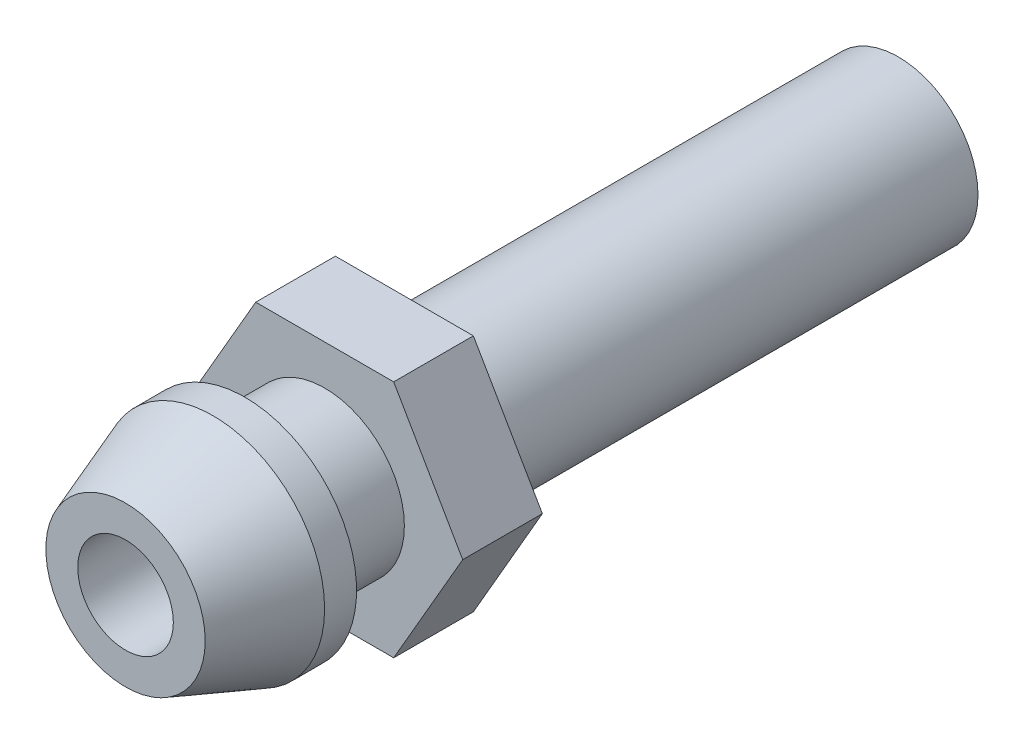
ISO-10303-21;
HEADER;
FILE_DESCRIPTION(('STEP AP214'),'2;1');
FILE_NAME('part.step','',(''),(''),'','','');
FILE_SCHEMA(('AUTOMOTIVE_DESIGN { 1 0 10303 214 1 1 1 1 }'));
ENDSEC;
DATA;
#1=APPLICATION_CONTEXT('core data for automotive mechanical design processes');
#2=APPLICATION_PROTOCOL_DEFINITION('international standard','automotive_design',2000,#1);
#3=PRODUCT_CONTEXT('',#1,'mechanical');
#4=PRODUCT('Part','Part','',(#3));
#5=PRODUCT_RELATED_PRODUCT_CATEGORY('part','',(#4));
#6=PRODUCT_DEFINITION_FORMATION('','',#4);
#7=PRODUCT_DEFINITION_CONTEXT('part definition',#1,'design');
#8=PRODUCT_DEFINITION('design','',#6,#7);
#9=PRODUCT_DEFINITION_SHAPE('','',#8);
#10=(LENGTH_UNIT() NAMED_UNIT(*) SI_UNIT(.MILLI.,.METRE.));
#11=(NAMED_UNIT(*) PLANE_ANGLE_UNIT() SI_UNIT($,.RADIAN.));
#12=(NAMED_UNIT(*) SI_UNIT($,.STERADIAN.) SOLID_ANGLE_UNIT());
#13=UNCERTAINTY_MEASURE_WITH_UNIT(LENGTH_MEASURE(1.E-05),#10,'distance_accuracy_value','');
#14=(GEOMETRIC_REPRESENTATION_CONTEXT(3) GLOBAL_UNCERTAINTY_ASSIGNED_CONTEXT((#13)) GLOBAL_UNIT_ASSIGNED_CONTEXT((#10,
#11,#12)) REPRESENTATION_CONTEXT('',''));
#15=CARTESIAN_POINT('',(0.,0.,0.));
#16=DIRECTION('',(0.,0.,1.));
#17=DIRECTION('',(1.,0.,0.));
#18=AXIS2_PLACEMENT_3D('',#15,#16,#17);
#19=CARTESIAN_POINT('',(0.,0.,12.319));
#20=DIRECTION('',(0.,0.,-1.));
#21=DIRECTION('',(1.,0.,0.));
#22=AXIS2_PLACEMENT_3D('',#19,#20,#21);
#23=CONICAL_SURFACE('',#22,1.27,0.349065850398867);
#24=CARTESIAN_POINT('',(0.,0.,12.319));
#25=DIRECTION('',(0.,0.,1.));
#26=DIRECTION('',(1.,0.,0.));
#27=AXIS2_PLACEMENT_3D('',#24,#25,#26);
#28=CIRCLE('',#27,1.27);
#29=CARTESIAN_POINT('',(1.27,0.,12.319));
#30=VERTEX_POINT('',#29);
#31=EDGE_CURVE('E11',#30,#30,#28,.T.);
#32=ORIENTED_EDGE('',*,*,#31,.F.);
#33=EDGE_LOOP('',(#32));
#34=FACE_BOUND('',#33,.T.);
#35=CARTESIAN_POINT('',(0.,0.,10.9232814709171));
#36=DIRECTION('',(0.,0.,-1.));
#37=DIRECTION('',(-1.,0.,0.));
#38=AXIS2_PLACEMENT_3D('',#35,#36,#37);
#39=CIRCLE('',#38,1.778);
#40=CARTESIAN_POINT('',(-1.778,0.,10.9232814709171));
#41=VERTEX_POINT('',#40);
#42=EDGE_CURVE('E61',#41,#41,#39,.T.);
#43=ORIENTED_EDGE('',*,*,#42,.F.);
#44=EDGE_LOOP('',(#43));
#45=FACE_BOUND('',#44,.T.);
#46=ADVANCED_FACE('F47',(#34,#45),#23,.T.);
#47=CARTESIAN_POINT('',(0.,0.,10.414));
#48=DIRECTION('',(0.,0.,1.));
#49=DIRECTION('',(1.,0.,0.));
#50=AXIS2_PLACEMENT_3D('',#47,#48,#49);
#51=PLANE('',#50);
#52=CARTESIAN_POINT('',(0.,0.,10.414));
#53=DIRECTION('',(0.,0.,1.));
#54=DIRECTION('',(1.,0.,0.));
#55=AXIS2_PLACEMENT_3D('',#52,#53,#54);
#56=CIRCLE('',#55,0.762);
#57=CARTESIAN_POINT('',(0.762,0.,10.414));
#58=VERTEX_POINT('',#57);
#59=EDGE_CURVE('E50',#58,#58,#56,.T.);
#60=ORIENTED_EDGE('',*,*,#59,.T.);
#61=EDGE_LOOP('',(#60));
#62=FACE_BOUND('',#61,.T.);
#63=CARTESIAN_POINT('',(0.,0.,10.414));
#64=DIRECTION('',(0.,0.,-1.));
#65=DIRECTION('',(-1.,0.,0.));
#66=AXIS2_PLACEMENT_3D('',#63,#64,#65);
#67=CIRCLE('',#66,1.778);
#68=CARTESIAN_POINT('',(-1.778,0.,10.414));
#69=VERTEX_POINT('',#68);
#70=EDGE_CURVE('E64',#69,#69,#67,.T.);
#71=ORIENTED_EDGE('',*,*,#70,.T.);
#72=EDGE_LOOP('',(#71));
#73=FACE_BOUND('',#72,.T.);
#74=ADVANCED_FACE('F68',(#62,#73),#51,.F.);
#75=CARTESIAN_POINT('',(0.,0.,12.319));
#76=DIRECTION('',(0.,0.,1.));
#77=DIRECTION('',(1.,0.,0.));
#78=AXIS2_PLACEMENT_3D('',#75,#76,#77);
#79=PLANE('',#78);
#80=CARTESIAN_POINT('',(0.,0.,12.319));
#81=DIRECTION('',(0.,0.,1.));
#82=DIRECTION('',(1.,0.,0.));
#83=AXIS2_PLACEMENT_3D('',#80,#81,#82);
#84=CIRCLE('',#83,0.762);
#85=CARTESIAN_POINT('',(0.762,0.,12.319));
#86=VERTEX_POINT('',#85);
#87=EDGE_CURVE('E57',#86,#86,#84,.T.);
#88=ORIENTED_EDGE('',*,*,#87,.F.);
#89=EDGE_LOOP('',(#88));
#90=FACE_BOUND('',#89,.T.);
#91=ORIENTED_EDGE('',*,*,#31,.T.);
#92=EDGE_LOOP('',(#91));
#93=FACE_BOUND('',#92,.T.);
#94=ADVANCED_FACE('F83',(#90,#93),#79,.T.);
#95=CARTESIAN_POINT('',(0.,0.,0.));
#96=DIRECTION('',(0.,0.,1.));
#97=DIRECTION('',(1.,0.,0.));
#98=AXIS2_PLACEMENT_3D('',#95,#96,#97);
#99=CYLINDRICAL_SURFACE('',#98,0.762);
#100=ORIENTED_EDGE('',*,*,#87,.T.);
#101=EDGE_LOOP('',(#100));
#102=FACE_BOUND('',#101,.T.);
#103=ORIENTED_EDGE('',*,*,#59,.F.);
#104=EDGE_LOOP('',(#103));
#105=FACE_BOUND('',#104,.T.);
#106=ADVANCED_FACE('F73',(#102,#105),#99,.F.);
#107=CARTESIAN_POINT('',(0.,0.,12.954));
#108=DIRECTION('',(0.,0.,-1.));
#109=DIRECTION('',(-1.,0.,0.));
#110=AXIS2_PLACEMENT_3D('',#107,#108,#109);
#111=CYLINDRICAL_SURFACE('',#110,1.778);
#112=ORIENTED_EDGE('',*,*,#70,.F.);
#113=EDGE_LOOP('',(#112));
#114=FACE_BOUND('',#113,.T.);
#115=ORIENTED_EDGE('',*,*,#42,.T.);
#116=EDGE_LOOP('',(#115));
#117=FACE_BOUND('',#116,.T.);
#118=ADVANCED_FACE('F70',(#114,#117),#111,.T.);
#119=CLOSED_SHELL('',(#46,#74,#94,#106,#118));
#120=MANIFOLD_SOLID_BREP('B2',#119);
#121=CARTESIAN_POINT('',(0.,0.,9.144));
#122=DIRECTION('',(0.,0.,1.));
#123=DIRECTION('',(1.,0.,0.));
#124=AXIS2_PLACEMENT_3D('',#121,#122,#123);
#125=PLANE('',#124);
#126=DIRECTION('',(0.5,0.866025403784439,0.));
#127=VECTOR('',#126,1.);
#128=CARTESIAN_POINT('',(1.09985226280624,-1.905,9.144));
#129=LINE('',#128,#127);
#130=CARTESIAN_POINT('',(1.09985226280624,-1.905,9.144));
#131=VERTEX_POINT('',#130);
#132=CARTESIAN_POINT('',(2.19970452561247,0.,9.144));
#133=VERTEX_POINT('',#132);
#134=EDGE_CURVE('E212',#131,#133,#129,.T.);
#135=ORIENTED_EDGE('',*,*,#134,.T.);
#136=DIRECTION('',(-0.5,0.866025403784439,0.));
#137=VECTOR('',#136,1.);
#138=CARTESIAN_POINT('',(2.19970452561247,0.,9.144));
#139=LINE('',#138,#137);
#140=CARTESIAN_POINT('',(1.09985226280624,1.905,9.144));
#141=VERTEX_POINT('',#140);
#142=EDGE_CURVE('E170',#133,#141,#139,.T.);
#143=ORIENTED_EDGE('',*,*,#142,.T.);
#144=DIRECTION('',(-1.,0.,0.));
#145=VECTOR('',#144,1.);
#146=CARTESIAN_POINT('',(1.09985226280624,1.905,9.144));
#147=LINE('',#146,#145);
#148=CARTESIAN_POINT('',(-1.09985226280624,1.905,9.144));
#149=VERTEX_POINT('',#148);
#150=EDGE_CURVE('E183',#141,#149,#147,.T.);
#151=ORIENTED_EDGE('',*,*,#150,.T.);
#152=DIRECTION('',(-0.5,-0.866025403784439,0.));
#153=VECTOR('',#152,1.);
#154=CARTESIAN_POINT('',(-1.09985226280624,1.905,9.144));
#155=LINE('',#154,#153);
#156=CARTESIAN_POINT('',(-2.19970452561247,0.,9.144));
#157=VERTEX_POINT('',#156);
#158=EDGE_CURVE('E177',#149,#157,#155,.T.);
#159=ORIENTED_EDGE('',*,*,#158,.T.);
#160=DIRECTION('',(0.5,-0.866025403784439,0.));
#161=VECTOR('',#160,1.);
#162=CARTESIAN_POINT('',(-2.19970452561247,0.,9.144));
#163=LINE('',#162,#161);
#164=CARTESIAN_POINT('',(-1.09985226280624,-1.905,9.144));
#165=VERTEX_POINT('',#164);
#166=EDGE_CURVE('E181',#157,#165,#163,.T.);
#167=ORIENTED_EDGE('',*,*,#166,.T.);
#168=DIRECTION('',(1.,0.,0.));
#169=VECTOR('',#168,1.);
#170=CARTESIAN_POINT('',(-1.09985226280624,-1.905,9.144));
#171=LINE('',#170,#169);
#172=EDGE_CURVE('E132',#165,#131,#171,.T.);
#173=ORIENTED_EDGE('',*,*,#172,.T.);
#174=EDGE_LOOP('',(#135,#143,#151,#159,#167,#173));
#175=FACE_BOUND('',#174,.T.);
#176=CARTESIAN_POINT('',(0.,0.,9.144));
#177=DIRECTION('',(0.,0.,1.));
#178=DIRECTION('',(1.,0.,0.));
#179=AXIS2_PLACEMENT_3D('',#176,#177,#178);
#180=CIRCLE('',#179,1.27);
#181=CARTESIAN_POINT('',(1.27,0.,9.144));
#182=VERTEX_POINT('',#181);
#183=EDGE_CURVE('E273',#182,#182,#180,.T.);
#184=ORIENTED_EDGE('',*,*,#183,.F.);
#185=EDGE_LOOP('',(#184));
#186=FACE_BOUND('',#185,.T.);
#187=ADVANCED_FACE('F114',(#175,#186),#125,.T.);
#188=CARTESIAN_POINT('',(0.,0.,6.35));
#189=DIRECTION('',(0.,0.,-1.));
#190=DIRECTION('',(-1.,0.,0.));
#191=AXIS2_PLACEMENT_3D('',#188,#189,#190);
#192=CYLINDRICAL_SURFACE('',#191,1.27);
#193=CARTESIAN_POINT('',(0.,0.,0.));
#194=DIRECTION('',(0.,0.,1.));
#195=DIRECTION('',(1.,0.,0.));
#196=AXIS2_PLACEMENT_3D('',#193,#194,#195);
#197=CIRCLE('',#196,1.27);
#198=CARTESIAN_POINT('',(1.27,0.,0.));
#199=VERTEX_POINT('',#198);
#200=EDGE_CURVE('E45',#199,#199,#197,.T.);
#201=ORIENTED_EDGE('',*,*,#200,.T.);
#202=EDGE_LOOP('',(#201));
#203=FACE_BOUND('',#202,.T.);
#204=CARTESIAN_POINT('',(0.,0.,7.874));
#205=DIRECTION('',(0.,0.,1.));
#206=DIRECTION('',(1.,0.,0.));
#207=AXIS2_PLACEMENT_3D('',#204,#205,#206);
#208=CIRCLE('',#207,1.27);
#209=CARTESIAN_POINT('',(1.27,0.,7.874));
#210=VERTEX_POINT('',#209);
#211=EDGE_CURVE('E124',#210,#210,#208,.T.);
#212=ORIENTED_EDGE('',*,*,#211,.F.);
#213=EDGE_LOOP('',(#212));
#214=FACE_BOUND('',#213,.T.);
#215=ADVANCED_FACE('F116',(#203,#214),#192,.T.);
#216=CARTESIAN_POINT('',(0.,0.,0.));
#217=DIRECTION('',(0.,0.,1.));
#218=DIRECTION('',(1.,0.,0.));
#219=AXIS2_PLACEMENT_3D('',#216,#217,#218);
#220=PLANE('',#219);
#221=CARTESIAN_POINT('',(0.,0.,0.));
#222=DIRECTION('',(0.,0.,1.));
#223=DIRECTION('',(1.,0.,0.));
#224=AXIS2_PLACEMENT_3D('',#221,#222,#223);
#225=CIRCLE('',#224,0.762);
#226=CARTESIAN_POINT('',(0.762,0.,0.));
#227=VERTEX_POINT('',#226);
#228=EDGE_CURVE('E278',#227,#227,#225,.T.);
#229=ORIENTED_EDGE('',*,*,#228,.T.);
#230=EDGE_LOOP('',(#229));
#231=FACE_BOUND('',#230,.T.);
#232=ORIENTED_EDGE('',*,*,#200,.F.);
#233=EDGE_LOOP('',(#232));
#234=FACE_BOUND('',#233,.T.);
#235=ADVANCED_FACE('F227',(#231,#234),#220,.F.);
#236=CARTESIAN_POINT('',(0.,0.,7.874));
#237=DIRECTION('',(0.,0.,1.));
#238=DIRECTION('',(1.,0.,0.));
#239=AXIS2_PLACEMENT_3D('',#236,#237,#238);
#240=PLANE('',#239);
#241=DIRECTION('',(0.5,0.866025403784439,0.));
#242=VECTOR('',#241,1.);
#243=CARTESIAN_POINT('',(1.09985226280624,-1.905,7.874));
#244=LINE('',#243,#242);
#245=CARTESIAN_POINT('',(1.09985226280624,-1.905,7.874));
#246=VERTEX_POINT('',#245);
#247=CARTESIAN_POINT('',(2.19970452561247,0.,7.874));
#248=VERTEX_POINT('',#247);
#249=EDGE_CURVE('E201',#246,#248,#244,.T.);
#250=ORIENTED_EDGE('',*,*,#249,.F.);
#251=DIRECTION('',(1.,0.,0.));
#252=VECTOR('',#251,1.);
#253=CARTESIAN_POINT('',(-1.09985226280624,-1.905,7.874));
#254=LINE('',#253,#252);
#255=CARTESIAN_POINT('',(-1.09985226280624,-1.905,7.874));
#256=VERTEX_POINT('',#255);
#257=EDGE_CURVE('E161',#256,#246,#254,.T.);
#258=ORIENTED_EDGE('',*,*,#257,.F.);
#259=DIRECTION('',(0.5,-0.866025403784439,0.));
#260=VECTOR('',#259,1.);
#261=CARTESIAN_POINT('',(-2.19970452561247,0.,7.874));
#262=LINE('',#261,#260);
#263=CARTESIAN_POINT('',(-2.19970452561247,0.,7.874));
#264=VERTEX_POINT('',#263);
#265=EDGE_CURVE('E155',#264,#256,#262,.T.);
#266=ORIENTED_EDGE('',*,*,#265,.F.);
#267=DIRECTION('',(-0.5,-0.866025403784439,0.));
#268=VECTOR('',#267,1.);
#269=CARTESIAN_POINT('',(-1.09985226280624,1.905,7.874));
#270=LINE('',#269,#268);
#271=CARTESIAN_POINT('',(-1.09985226280624,1.905,7.874));
#272=VERTEX_POINT('',#271);
#273=EDGE_CURVE('E191',#272,#264,#270,.T.);
#274=ORIENTED_EDGE('',*,*,#273,.F.);
#275=DIRECTION('',(-1.,0.,0.));
#276=VECTOR('',#275,1.);
#277=CARTESIAN_POINT('',(1.09985226280624,1.905,7.874));
#278=LINE('',#277,#276);
#279=CARTESIAN_POINT('',(1.09985226280624,1.905,7.874));
#280=VERTEX_POINT('',#279);
#281=EDGE_CURVE('E207',#280,#272,#278,.T.);
#282=ORIENTED_EDGE('',*,*,#281,.F.);
#283=DIRECTION('',(-0.5,0.866025403784439,0.));
#284=VECTOR('',#283,1.);
#285=CARTESIAN_POINT('',(2.19970452561247,0.,7.874));
#286=LINE('',#285,#284);
#287=EDGE_CURVE('E204',#248,#280,#286,.T.);
#288=ORIENTED_EDGE('',*,*,#287,.F.);
#289=EDGE_LOOP('',(#250,#258,#266,#274,#282,#288));
#290=FACE_BOUND('',#289,.T.);
#291=ORIENTED_EDGE('',*,*,#211,.T.);
#292=EDGE_LOOP('',(#291));
#293=FACE_BOUND('',#292,.T.);
#294=ADVANCED_FACE('F224',(#290,#293),#240,.F.);
#295=CARTESIAN_POINT('',(1.09985226280624,-1.905,9.144));
#296=DIRECTION('',(-0.866025403784439,0.5,0.));
#297=DIRECTION('',(-0.5,-0.866025403784439,0.));
#298=AXIS2_PLACEMENT_3D('',#295,#296,#297);
#299=PLANE('',#298);
#300=ORIENTED_EDGE('',*,*,#249,.T.);
#301=DIRECTION('',(0.,0.,-1.));
#302=VECTOR('',#301,1.);
#303=CARTESIAN_POINT('',(2.19970452561247,0.,9.144));
#304=LINE('',#303,#302);
#305=EDGE_CURVE('E219',#133,#248,#304,.T.);
#306=ORIENTED_EDGE('',*,*,#305,.F.);
#307=ORIENTED_EDGE('',*,*,#134,.F.);
#308=DIRECTION('',(0.,0.,-1.));
#309=VECTOR('',#308,1.);
#310=CARTESIAN_POINT('',(1.09985226280624,-1.905,9.144));
#311=LINE('',#310,#309);
#312=EDGE_CURVE('E197',#131,#246,#311,.T.);
#313=ORIENTED_EDGE('',*,*,#312,.T.);
#314=EDGE_LOOP('',(#300,#306,#307,#313));
#315=FACE_BOUND('',#314,.T.);
#316=ADVANCED_FACE('F247',(#315),#299,.F.);
#317=CARTESIAN_POINT('',(2.19970452561247,0.,9.144));
#318=DIRECTION('',(-0.866025403784438,-0.5,0.));
#319=DIRECTION('',(0.5,-0.866025403784439,0.));
#320=AXIS2_PLACEMENT_3D('',#317,#318,#319);
#321=PLANE('',#320);
#322=ORIENTED_EDGE('',*,*,#287,.T.);
#323=DIRECTION('',(0.,0.,-1.));
#324=VECTOR('',#323,1.);
#325=CARTESIAN_POINT('',(1.09985226280624,1.905,9.144));
#326=LINE('',#325,#324);
#327=EDGE_CURVE('E216',#141,#280,#326,.T.);
#328=ORIENTED_EDGE('',*,*,#327,.F.);
#329=ORIENTED_EDGE('',*,*,#142,.F.);
#330=ORIENTED_EDGE('',*,*,#305,.T.);
#331=EDGE_LOOP('',(#322,#328,#329,#330));
#332=FACE_BOUND('',#331,.T.);
#333=ADVANCED_FACE('F258',(#332),#321,.F.);
#334=CARTESIAN_POINT('',(1.09985226280624,1.905,9.144));
#335=DIRECTION('',(0.,-1.,0.));
#336=DIRECTION('',(1.,0.,0.));
#337=AXIS2_PLACEMENT_3D('',#334,#335,#336);
#338=PLANE('',#337);
#339=ORIENTED_EDGE('',*,*,#281,.T.);
#340=DIRECTION('',(0.,0.,-1.));
#341=VECTOR('',#340,1.);
#342=CARTESIAN_POINT('',(-1.09985226280624,1.905,9.144));
#343=LINE('',#342,#341);
#344=EDGE_CURVE('E192',#149,#272,#343,.T.);
#345=ORIENTED_EDGE('',*,*,#344,.F.);
#346=ORIENTED_EDGE('',*,*,#150,.F.);
#347=ORIENTED_EDGE('',*,*,#327,.T.);
#348=EDGE_LOOP('',(#339,#345,#346,#347));
#349=FACE_BOUND('',#348,.T.);
#350=ADVANCED_FACE('F255',(#349),#338,.F.);
#351=CARTESIAN_POINT('',(-1.09985226280624,1.905,9.144));
#352=DIRECTION('',(0.866025403784439,-0.5,0.));
#353=DIRECTION('',(0.5,0.866025403784439,0.));
#354=AXIS2_PLACEMENT_3D('',#351,#352,#353);
#355=PLANE('',#354);
#356=ORIENTED_EDGE('',*,*,#273,.T.);
#357=DIRECTION('',(0.,0.,-1.));
#358=VECTOR('',#357,1.);
#359=CARTESIAN_POINT('',(-2.19970452561247,0.,9.144));
#360=LINE('',#359,#358);
#361=EDGE_CURVE('E188',#157,#264,#360,.T.);
#362=ORIENTED_EDGE('',*,*,#361,.F.);
#363=ORIENTED_EDGE('',*,*,#158,.F.);
#364=ORIENTED_EDGE('',*,*,#344,.T.);
#365=EDGE_LOOP('',(#356,#362,#363,#364));
#366=FACE_BOUND('',#365,.T.);
#367=ADVANCED_FACE('F189',(#366),#355,.F.);
#368=CARTESIAN_POINT('',(-2.19970452561247,0.,9.144));
#369=DIRECTION('',(0.866025403784439,0.5,0.));
#370=DIRECTION('',(-0.5,0.866025403784439,0.));
#371=AXIS2_PLACEMENT_3D('',#368,#369,#370);
#372=PLANE('',#371);
#373=ORIENTED_EDGE('',*,*,#265,.T.);
#374=DIRECTION('',(0.,0.,-1.));
#375=VECTOR('',#374,1.);
#376=CARTESIAN_POINT('',(-1.09985226280624,-1.905,9.144));
#377=LINE('',#376,#375);
#378=EDGE_CURVE('E193',#165,#256,#377,.T.);
#379=ORIENTED_EDGE('',*,*,#378,.F.);
#380=ORIENTED_EDGE('',*,*,#166,.F.);
#381=ORIENTED_EDGE('',*,*,#361,.T.);
#382=EDGE_LOOP('',(#373,#379,#380,#381));
#383=FACE_BOUND('',#382,.T.);
#384=ADVANCED_FACE('F195',(#383),#372,.F.);
#385=CARTESIAN_POINT('',(-1.09985226280624,-1.905,9.144));
#386=DIRECTION('',(0.,1.,0.));
#387=DIRECTION('',(0.,0.,1.));
#388=AXIS2_PLACEMENT_3D('',#385,#386,#387);
#389=PLANE('',#388);
#390=ORIENTED_EDGE('',*,*,#257,.T.);
#391=ORIENTED_EDGE('',*,*,#312,.F.);
#392=ORIENTED_EDGE('',*,*,#172,.F.);
#393=ORIENTED_EDGE('',*,*,#378,.T.);
#394=EDGE_LOOP('',(#390,#391,#392,#393));
#395=FACE_BOUND('',#394,.T.);
#396=ADVANCED_FACE('F249',(#395),#389,.F.);
#397=CARTESIAN_POINT('',(0.,0.,10.414));
#398=DIRECTION('',(0.,0.,-1.));
#399=DIRECTION('',(-1.,0.,0.));
#400=AXIS2_PLACEMENT_3D('',#397,#398,#399);
#401=CYLINDRICAL_SURFACE('',#400,1.27);
#402=CARTESIAN_POINT('',(0.,0.,10.414));
#403=DIRECTION('',(0.,0.,1.));
#404=DIRECTION('',(1.,0.,0.));
#405=AXIS2_PLACEMENT_3D('',#402,#403,#404);
#406=CIRCLE('',#405,1.27);
#407=CARTESIAN_POINT('',(1.27,0.,10.414));
#408=VERTEX_POINT('',#407);
#409=EDGE_CURVE('E205',#408,#408,#406,.T.);
#410=ORIENTED_EDGE('',*,*,#409,.F.);
#411=EDGE_LOOP('',(#410));
#412=FACE_BOUND('',#411,.T.);
#413=ORIENTED_EDGE('',*,*,#183,.T.);
#414=EDGE_LOOP('',(#413));
#415=FACE_BOUND('',#414,.T.);
#416=ADVANCED_FACE('F244',(#412,#415),#401,.T.);
#417=CARTESIAN_POINT('',(0.,0.,10.414));
#418=DIRECTION('',(0.,0.,1.));
#419=DIRECTION('',(1.,0.,0.));
#420=AXIS2_PLACEMENT_3D('',#417,#418,#419);
#421=PLANE('',#420);
#422=CARTESIAN_POINT('',(0.,0.,10.414));
#423=DIRECTION('',(0.,0.,1.));
#424=DIRECTION('',(1.,0.,0.));
#425=AXIS2_PLACEMENT_3D('',#422,#423,#424);
#426=CIRCLE('',#425,0.762);
#427=CARTESIAN_POINT('',(0.762,0.,10.414));
#428=VERTEX_POINT('',#427);
#429=EDGE_CURVE('E118',#428,#428,#426,.T.);
#430=ORIENTED_EDGE('',*,*,#429,.F.);
#431=EDGE_LOOP('',(#430));
#432=FACE_BOUND('',#431,.T.);
#433=ORIENTED_EDGE('',*,*,#409,.T.);
#434=EDGE_LOOP('',(#433));
#435=FACE_BOUND('',#434,.T.);
#436=ADVANCED_FACE('F287',(#432,#435),#421,.T.);
#437=CARTESIAN_POINT('',(0.,0.,0.));
#438=DIRECTION('',(0.,0.,1.));
#439=DIRECTION('',(1.,0.,0.));
#440=AXIS2_PLACEMENT_3D('',#437,#438,#439);
#441=CYLINDRICAL_SURFACE('',#440,0.762);
#442=ORIENTED_EDGE('',*,*,#429,.T.);
#443=EDGE_LOOP('',(#442));
#444=FACE_BOUND('',#443,.T.);
#445=ORIENTED_EDGE('',*,*,#228,.F.);
#446=EDGE_LOOP('',(#445));
#447=FACE_BOUND('',#446,.T.);
#448=ADVANCED_FACE('F284',(#444,#447),#441,.F.);
#449=CLOSED_SHELL('',(#187,#215,#235,#294,#316,#333,#350,#367,#384,#396,#416,#436,#448));
#450=MANIFOLD_SOLID_BREP('B6',#449);
#451=ADVANCED_BREP_SHAPE_REPRESENTATION('',(#18,#120,#450),#14);
#452=SHAPE_DEFINITION_REPRESENTATION(#9,#451);
ENDSEC;
END-ISO-10303-21;
